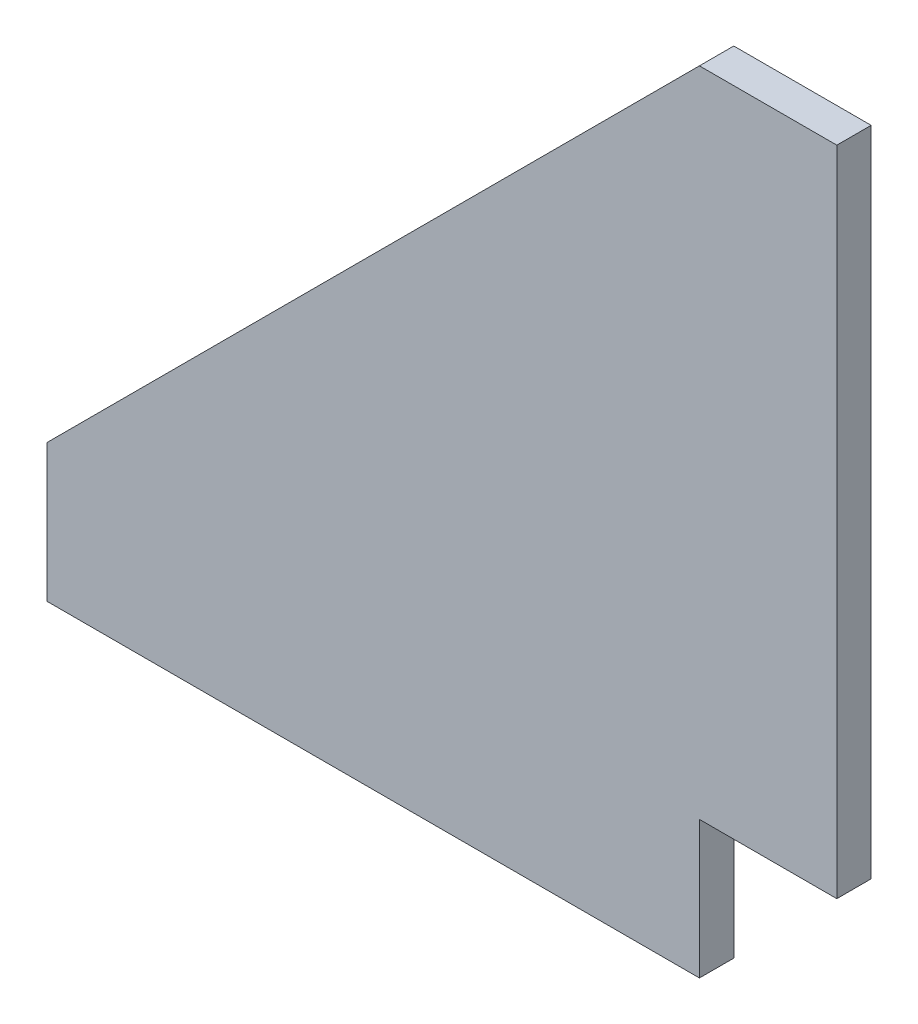
ISO-10303-21;
HEADER;
FILE_DESCRIPTION(('STEP AP214'),'2;1');
FILE_NAME('part.step','',(''),(''),'','','');
FILE_SCHEMA(('AUTOMOTIVE_DESIGN { 1 0 10303 214 1 1 1 1 }'));
ENDSEC;
DATA;
#1=APPLICATION_CONTEXT('core data for automotive mechanical design processes');
#2=APPLICATION_PROTOCOL_DEFINITION('international standard','automotive_design',2000,#1);
#3=PRODUCT_CONTEXT('',#1,'mechanical');
#4=PRODUCT('Part','Part','',(#3));
#5=PRODUCT_RELATED_PRODUCT_CATEGORY('part','',(#4));
#6=PRODUCT_DEFINITION_FORMATION('','',#4);
#7=PRODUCT_DEFINITION_CONTEXT('part definition',#1,'design');
#8=PRODUCT_DEFINITION('design','',#6,#7);
#9=PRODUCT_DEFINITION_SHAPE('','',#8);
#10=(LENGTH_UNIT() NAMED_UNIT(*) SI_UNIT(.MILLI.,.METRE.));
#11=(NAMED_UNIT(*) PLANE_ANGLE_UNIT() SI_UNIT($,.RADIAN.));
#12=(NAMED_UNIT(*) SI_UNIT($,.STERADIAN.) SOLID_ANGLE_UNIT());
#13=UNCERTAINTY_MEASURE_WITH_UNIT(LENGTH_MEASURE(1.E-05),#10,'distance_accuracy_value','');
#14=(GEOMETRIC_REPRESENTATION_CONTEXT(3) GLOBAL_UNCERTAINTY_ASSIGNED_CONTEXT((#13)) GLOBAL_UNIT_ASSIGNED_CONTEXT((#10,
#11,#12)) REPRESENTATION_CONTEXT('',''));
#15=CARTESIAN_POINT('',(0.,0.,0.));
#16=DIRECTION('',(0.,0.,1.));
#17=DIRECTION('',(1.,0.,0.));
#18=AXIS2_PLACEMENT_3D('',#15,#16,#17);
#19=CARTESIAN_POINT('',(0.,25.3999999999993,6.35));
#20=DIRECTION('',(1.,0.,0.));
#21=DIRECTION('',(0.,1.,0.));
#22=AXIS2_PLACEMENT_3D('',#19,#20,#21);
#23=PLANE('',#22);
#24=DIRECTION('',(0.,-1.,0.));
#25=VECTOR('',#24,1.);
#26=CARTESIAN_POINT('',(0.,25.3999999999993,0.));
#27=LINE('',#26,#25);
#28=CARTESIAN_POINT('',(0.,25.3999999999993,0.));
#29=VERTEX_POINT('',#28);
#30=CARTESIAN_POINT('',(0.,0.,0.));
#31=VERTEX_POINT('',#30);
#32=EDGE_CURVE('E131',#29,#31,#27,.T.);
#33=ORIENTED_EDGE('',*,*,#32,.T.);
#34=DIRECTION('',(0.,0.,-1.));
#35=VECTOR('',#34,1.);
#36=CARTESIAN_POINT('',(0.,0.,6.35));
#37=LINE('',#36,#35);
#38=CARTESIAN_POINT('',(0.,0.,6.35));
#39=VERTEX_POINT('',#38);
#40=EDGE_CURVE('E11',#39,#31,#37,.T.);
#41=ORIENTED_EDGE('',*,*,#40,.F.);
#42=DIRECTION('',(0.,-1.,0.));
#43=VECTOR('',#42,1.);
#44=CARTESIAN_POINT('',(0.,25.3999999999993,6.35));
#45=LINE('',#44,#43);
#46=CARTESIAN_POINT('',(0.,25.3999999999993,6.35));
#47=VERTEX_POINT('',#46);
#48=EDGE_CURVE('E143',#47,#39,#45,.T.);
#49=ORIENTED_EDGE('',*,*,#48,.F.);
#50=DIRECTION('',(0.,0.,-1.));
#51=VECTOR('',#50,1.);
#52=CARTESIAN_POINT('',(0.,25.3999999999993,6.35));
#53=LINE('',#52,#51);
#54=EDGE_CURVE('E127',#47,#29,#53,.T.);
#55=ORIENTED_EDGE('',*,*,#54,.T.);
#56=EDGE_LOOP('',(#33,#41,#49,#55));
#57=FACE_BOUND('',#56,.T.);
#58=ADVANCED_FACE('F41',(#57),#23,.F.);
#59=CARTESIAN_POINT('',(0.,0.,6.35));
#60=DIRECTION('',(0.,1.,0.));
#61=DIRECTION('',(0.,0.,1.));
#62=AXIS2_PLACEMENT_3D('',#59,#60,#61);
#63=PLANE('',#62);
#64=DIRECTION('',(1.,0.,0.));
#65=VECTOR('',#64,1.);
#66=CARTESIAN_POINT('',(0.,0.,0.));
#67=LINE('',#66,#65);
#68=CARTESIAN_POINT('',(120.65,0.,0.));
#69=VERTEX_POINT('',#68);
#70=EDGE_CURVE('E134',#31,#69,#67,.T.);
#71=ORIENTED_EDGE('',*,*,#70,.T.);
#72=DIRECTION('',(0.,0.,-1.));
#73=VECTOR('',#72,1.);
#74=CARTESIAN_POINT('',(120.65,0.,6.35));
#75=LINE('',#74,#73);
#76=CARTESIAN_POINT('',(120.65,0.,6.35));
#77=VERTEX_POINT('',#76);
#78=EDGE_CURVE('E49',#77,#69,#75,.T.);
#79=ORIENTED_EDGE('',*,*,#78,.F.);
#80=DIRECTION('',(1.,0.,0.));
#81=VECTOR('',#80,1.);
#82=CARTESIAN_POINT('',(0.,0.,6.35));
#83=LINE('',#82,#81);
#84=EDGE_CURVE('E97',#39,#77,#83,.T.);
#85=ORIENTED_EDGE('',*,*,#84,.F.);
#86=ORIENTED_EDGE('',*,*,#40,.T.);
#87=EDGE_LOOP('',(#71,#79,#85,#86));
#88=FACE_BOUND('',#87,.T.);
#89=ADVANCED_FACE('F168',(#88),#63,.F.);
#90=CARTESIAN_POINT('',(120.65,0.,6.35));
#91=DIRECTION('',(-1.,0.,0.));
#92=DIRECTION('',(0.,0.,1.));
#93=AXIS2_PLACEMENT_3D('',#90,#91,#92);
#94=PLANE('',#93);
#95=DIRECTION('',(0.,1.,0.));
#96=VECTOR('',#95,1.);
#97=CARTESIAN_POINT('',(120.65,0.,0.));
#98=LINE('',#97,#96);
#99=CARTESIAN_POINT('',(120.65,25.4,0.));
#100=VERTEX_POINT('',#99);
#101=EDGE_CURVE('E136',#69,#100,#98,.T.);
#102=ORIENTED_EDGE('',*,*,#101,.T.);
#103=DIRECTION('',(0.,0.,-1.));
#104=VECTOR('',#103,1.);
#105=CARTESIAN_POINT('',(120.65,25.4,6.35));
#106=LINE('',#105,#104);
#107=CARTESIAN_POINT('',(120.65,25.4,6.35));
#108=VERTEX_POINT('',#107);
#109=EDGE_CURVE('E147',#108,#100,#106,.T.);
#110=ORIENTED_EDGE('',*,*,#109,.F.);
#111=DIRECTION('',(0.,1.,0.));
#112=VECTOR('',#111,1.);
#113=CARTESIAN_POINT('',(120.65,0.,6.35));
#114=LINE('',#113,#112);
#115=EDGE_CURVE('E155',#77,#108,#114,.T.);
#116=ORIENTED_EDGE('',*,*,#115,.F.);
#117=ORIENTED_EDGE('',*,*,#78,.T.);
#118=EDGE_LOOP('',(#102,#110,#116,#117));
#119=FACE_BOUND('',#118,.T.);
#120=ADVANCED_FACE('F153',(#119),#94,.F.);
#121=CARTESIAN_POINT('',(120.65,25.4,6.35));
#122=DIRECTION('',(0.,1.,0.));
#123=DIRECTION('',(0.,0.,1.));
#124=AXIS2_PLACEMENT_3D('',#121,#122,#123);
#125=PLANE('',#124);
#126=DIRECTION('',(1.,0.,0.));
#127=VECTOR('',#126,1.);
#128=CARTESIAN_POINT('',(120.65,25.4,0.));
#129=LINE('',#128,#127);
#130=CARTESIAN_POINT('',(146.05,25.4,0.));
#131=VERTEX_POINT('',#130);
#132=EDGE_CURVE('E138',#100,#131,#129,.T.);
#133=ORIENTED_EDGE('',*,*,#132,.T.);
#134=DIRECTION('',(0.,0.,-1.));
#135=VECTOR('',#134,1.);
#136=CARTESIAN_POINT('',(146.05,25.4,6.35));
#137=LINE('',#136,#135);
#138=CARTESIAN_POINT('',(146.05,25.4,6.35));
#139=VERTEX_POINT('',#138);
#140=EDGE_CURVE('E122',#139,#131,#137,.T.);
#141=ORIENTED_EDGE('',*,*,#140,.F.);
#142=DIRECTION('',(1.,0.,0.));
#143=VECTOR('',#142,1.);
#144=CARTESIAN_POINT('',(120.65,25.4,6.35));
#145=LINE('',#144,#143);
#146=EDGE_CURVE('E113',#108,#139,#145,.T.);
#147=ORIENTED_EDGE('',*,*,#146,.F.);
#148=ORIENTED_EDGE('',*,*,#109,.T.);
#149=EDGE_LOOP('',(#133,#141,#147,#148));
#150=FACE_BOUND('',#149,.T.);
#151=ADVANCED_FACE('F161',(#150),#125,.F.);
#152=CARTESIAN_POINT('',(146.05,25.4,6.35));
#153=DIRECTION('',(-1.,0.,0.));
#154=DIRECTION('',(0.,0.,1.));
#155=AXIS2_PLACEMENT_3D('',#152,#153,#154);
#156=PLANE('',#155);
#157=DIRECTION('',(0.,1.,0.));
#158=VECTOR('',#157,1.);
#159=CARTESIAN_POINT('',(146.05,25.4,0.));
#160=LINE('',#159,#158);
#161=CARTESIAN_POINT('',(146.05,146.05,0.));
#162=VERTEX_POINT('',#161);
#163=EDGE_CURVE('E121',#131,#162,#160,.T.);
#164=ORIENTED_EDGE('',*,*,#163,.T.);
#165=DIRECTION('',(0.,0.,-1.));
#166=VECTOR('',#165,1.);
#167=CARTESIAN_POINT('',(146.05,146.05,6.35));
#168=LINE('',#167,#166);
#169=CARTESIAN_POINT('',(146.05,146.05,6.35));
#170=VERTEX_POINT('',#169);
#171=EDGE_CURVE('E118',#170,#162,#168,.T.);
#172=ORIENTED_EDGE('',*,*,#171,.F.);
#173=DIRECTION('',(0.,1.,0.));
#174=VECTOR('',#173,1.);
#175=CARTESIAN_POINT('',(146.05,25.4,6.35));
#176=LINE('',#175,#174);
#177=EDGE_CURVE('E107',#139,#170,#176,.T.);
#178=ORIENTED_EDGE('',*,*,#177,.F.);
#179=ORIENTED_EDGE('',*,*,#140,.T.);
#180=EDGE_LOOP('',(#164,#172,#178,#179));
#181=FACE_BOUND('',#180,.T.);
#182=ADVANCED_FACE('F119',(#181),#156,.F.);
#183=CARTESIAN_POINT('',(146.05,146.05,6.35));
#184=DIRECTION('',(0.,-1.,0.));
#185=DIRECTION('',(0.,0.,-1.));
#186=AXIS2_PLACEMENT_3D('',#183,#184,#185);
#187=PLANE('',#186);
#188=DIRECTION('',(-1.,0.,0.));
#189=VECTOR('',#188,1.);
#190=CARTESIAN_POINT('',(146.05,146.05,0.));
#191=LINE('',#190,#189);
#192=CARTESIAN_POINT('',(120.65,146.05,0.));
#193=VERTEX_POINT('',#192);
#194=EDGE_CURVE('E83',#162,#193,#191,.T.);
#195=ORIENTED_EDGE('',*,*,#194,.T.);
#196=DIRECTION('',(0.,0.,-1.));
#197=VECTOR('',#196,1.);
#198=CARTESIAN_POINT('',(120.65,146.05,6.35));
#199=LINE('',#198,#197);
#200=CARTESIAN_POINT('',(120.65,146.05,6.35));
#201=VERTEX_POINT('',#200);
#202=EDGE_CURVE('E123',#201,#193,#199,.T.);
#203=ORIENTED_EDGE('',*,*,#202,.F.);
#204=DIRECTION('',(-1.,0.,0.));
#205=VECTOR('',#204,1.);
#206=CARTESIAN_POINT('',(146.05,146.05,6.35));
#207=LINE('',#206,#205);
#208=EDGE_CURVE('E111',#170,#201,#207,.T.);
#209=ORIENTED_EDGE('',*,*,#208,.F.);
#210=ORIENTED_EDGE('',*,*,#171,.T.);
#211=EDGE_LOOP('',(#195,#203,#209,#210));
#212=FACE_BOUND('',#211,.T.);
#213=ADVANCED_FACE('F125',(#212),#187,.F.);
#214=CARTESIAN_POINT('',(120.65,146.05,6.35));
#215=DIRECTION('',(0.70710678118655,-0.707106781186545,0.));
#216=DIRECTION('',(0.707106781186545,0.70710678118655,0.));
#217=AXIS2_PLACEMENT_3D('',#214,#215,#216);
#218=PLANE('',#217);
#219=DIRECTION('',(-0.707106781186545,-0.70710678118655,0.));
#220=VECTOR('',#219,1.);
#221=CARTESIAN_POINT('',(120.65,146.05,0.));
#222=LINE('',#221,#220);
#223=EDGE_CURVE('E89',#193,#29,#222,.T.);
#224=ORIENTED_EDGE('',*,*,#223,.T.);
#225=ORIENTED_EDGE('',*,*,#54,.F.);
#226=DIRECTION('',(-0.707106781186545,-0.70710678118655,0.));
#227=VECTOR('',#226,1.);
#228=CARTESIAN_POINT('',(120.65,146.05,6.35));
#229=LINE('',#228,#227);
#230=EDGE_CURVE('E57',#201,#47,#229,.T.);
#231=ORIENTED_EDGE('',*,*,#230,.F.);
#232=ORIENTED_EDGE('',*,*,#202,.T.);
#233=EDGE_LOOP('',(#224,#225,#231,#232));
#234=FACE_BOUND('',#233,.T.);
#235=ADVANCED_FACE('F182',(#234),#218,.F.);
#236=CARTESIAN_POINT('',(0.,0.,6.35));
#237=DIRECTION('',(0.,0.,1.));
#238=DIRECTION('',(1.,0.,0.));
#239=AXIS2_PLACEMENT_3D('',#236,#237,#238);
#240=PLANE('',#239);
#241=ORIENTED_EDGE('',*,*,#48,.T.);
#242=ORIENTED_EDGE('',*,*,#84,.T.);
#243=ORIENTED_EDGE('',*,*,#115,.T.);
#244=ORIENTED_EDGE('',*,*,#146,.T.);
#245=ORIENTED_EDGE('',*,*,#177,.T.);
#246=ORIENTED_EDGE('',*,*,#208,.T.);
#247=ORIENTED_EDGE('',*,*,#230,.T.);
#248=EDGE_LOOP('',(#241,#242,#243,#244,#245,#246,#247));
#249=FACE_BOUND('',#248,.T.);
#250=ADVANCED_FACE('F109',(#249),#240,.T.);
#251=CARTESIAN_POINT('',(0.,0.,0.));
#252=DIRECTION('',(0.,0.,1.));
#253=DIRECTION('',(1.,0.,0.));
#254=AXIS2_PLACEMENT_3D('',#251,#252,#253);
#255=PLANE('',#254);
#256=ORIENTED_EDGE('',*,*,#32,.F.);
#257=ORIENTED_EDGE('',*,*,#223,.F.);
#258=ORIENTED_EDGE('',*,*,#194,.F.);
#259=ORIENTED_EDGE('',*,*,#163,.F.);
#260=ORIENTED_EDGE('',*,*,#132,.F.);
#261=ORIENTED_EDGE('',*,*,#101,.F.);
#262=ORIENTED_EDGE('',*,*,#70,.F.);
#263=EDGE_LOOP('',(#256,#257,#258,#259,#260,#261,#262));
#264=FACE_BOUND('',#263,.T.);
#265=ADVANCED_FACE('F159',(#264),#255,.F.);
#266=CLOSED_SHELL('',(#58,#89,#120,#151,#182,#213,#235,#250,#265));
#267=MANIFOLD_SOLID_BREP('B2',#266);
#268=ADVANCED_BREP_SHAPE_REPRESENTATION('',(#18,#267),#14);
#269=SHAPE_DEFINITION_REPRESENTATION(#9,#268);
ENDSEC;
END-ISO-10303-21;
